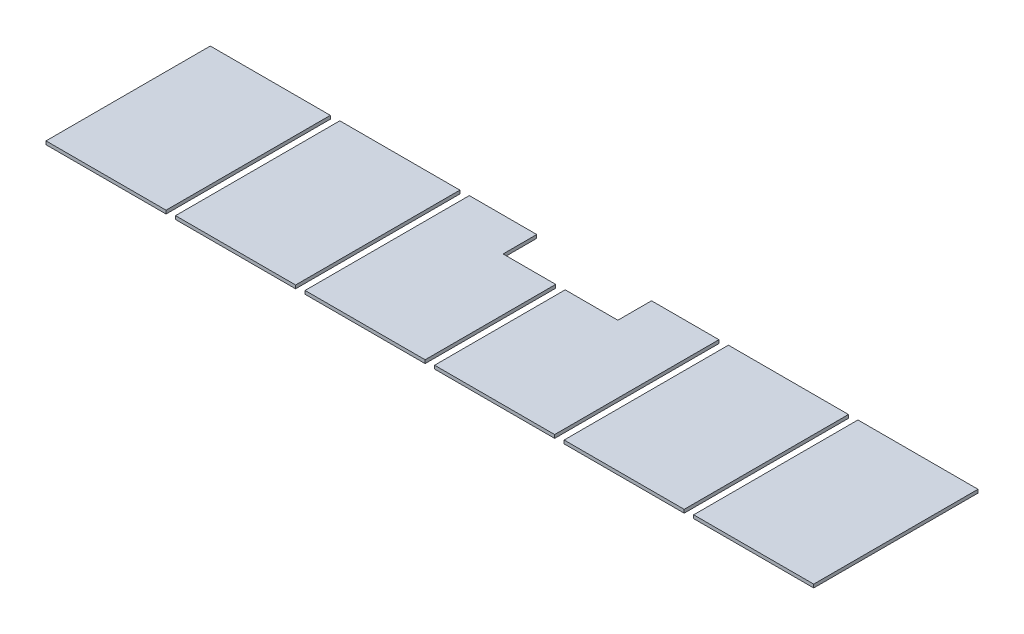
ISO-10303-21;
HEADER;
FILE_DESCRIPTION(('STEP AP214'),'2;1');
FILE_NAME('part.step','',(''),(''),'','','');
FILE_SCHEMA(('AUTOMOTIVE_DESIGN { 1 0 10303 214 1 1 1 1 }'));
ENDSEC;
DATA;
#1=APPLICATION_CONTEXT('core data for automotive mechanical design processes');
#2=APPLICATION_PROTOCOL_DEFINITION('international standard','automotive_design',2000,#1);
#3=PRODUCT_CONTEXT('',#1,'mechanical');
#4=PRODUCT('Part','Part','',(#3));
#5=PRODUCT_RELATED_PRODUCT_CATEGORY('part','',(#4));
#6=PRODUCT_DEFINITION_FORMATION('','',#4);
#7=PRODUCT_DEFINITION_CONTEXT('part definition',#1,'design');
#8=PRODUCT_DEFINITION('design','',#6,#7);
#9=PRODUCT_DEFINITION_SHAPE('','',#8);
#10=(LENGTH_UNIT() NAMED_UNIT(*) SI_UNIT(.MILLI.,.METRE.));
#11=(NAMED_UNIT(*) PLANE_ANGLE_UNIT() SI_UNIT($,.RADIAN.));
#12=(NAMED_UNIT(*) SI_UNIT($,.STERADIAN.) SOLID_ANGLE_UNIT());
#13=UNCERTAINTY_MEASURE_WITH_UNIT(LENGTH_MEASURE(1.E-05),#10,'distance_accuracy_value','');
#14=(GEOMETRIC_REPRESENTATION_CONTEXT(3) GLOBAL_UNCERTAINTY_ASSIGNED_CONTEXT((#13)) GLOBAL_UNIT_ASSIGNED_CONTEXT((#10,
#11,#12)) REPRESENTATION_CONTEXT('',''));
#15=CARTESIAN_POINT('',(0.,0.,0.));
#16=DIRECTION('',(0.,0.,1.));
#17=DIRECTION('',(1.,0.,0.));
#18=AXIS2_PLACEMENT_3D('',#15,#16,#17);
#19=CARTESIAN_POINT('',(0.,2494.46930946714,-63.5000000000028));
#20=DIRECTION('',(0.,0.,-1.));
#21=DIRECTION('',(-1.,0.,0.));
#22=AXIS2_PLACEMENT_3D('',#19,#20,#21);
#23=PLANE('',#22);
#24=DIRECTION('',(1.,0.,0.));
#25=VECTOR('',#24,1.);
#26=CARTESIAN_POINT('',(0.,40.6399999999998,-63.5000000000028));
#27=LINE('',#26,#25);
#28=CARTESIAN_POINT('',(7874.,40.6399999999998,-63.5000000000028));
#29=VERTEX_POINT('',#28);
#30=CARTESIAN_POINT('',(9321.8,40.6399999999998,-63.5000000000028));
#31=VERTEX_POINT('',#30);
#32=EDGE_CURVE('E97',#29,#31,#27,.T.);
#33=ORIENTED_EDGE('',*,*,#32,.F.);
#34=DIRECTION('',(0.,-1.,0.));
#35=VECTOR('',#34,1.);
#36=CARTESIAN_POINT('',(7874.,2494.46930946714,-63.5000000000028));
#37=LINE('',#36,#35);
#38=CARTESIAN_POINT('',(7874.,0.,-63.5000000000028));
#39=VERTEX_POINT('',#38);
#40=EDGE_CURVE('E51',#29,#39,#37,.T.);
#41=ORIENTED_EDGE('',*,*,#40,.T.);
#42=DIRECTION('',(1.,0.,0.));
#43=VECTOR('',#42,1.);
#44=CARTESIAN_POINT('',(0.,0.,-63.5000000000028));
#45=LINE('',#44,#43);
#46=CARTESIAN_POINT('',(9321.8,0.,-63.5000000000028));
#47=VERTEX_POINT('',#46);
#48=EDGE_CURVE('E95',#39,#47,#45,.T.);
#49=ORIENTED_EDGE('',*,*,#48,.T.);
#50=DIRECTION('',(0.,-1.,0.));
#51=VECTOR('',#50,1.);
#52=CARTESIAN_POINT('',(9321.8,2494.46930946714,-63.5000000000028));
#53=LINE('',#52,#51);
#54=EDGE_CURVE('E86',#31,#47,#53,.T.);
#55=ORIENTED_EDGE('',*,*,#54,.F.);
#56=EDGE_LOOP('',(#33,#41,#49,#55));
#57=FACE_BOUND('',#56,.T.);
#58=ADVANCED_FACE('F47',(#57),#23,.F.);
#59=CARTESIAN_POINT('',(9321.8,2494.46930946714,0.));
#60=DIRECTION('',(-1.,0.,0.));
#61=DIRECTION('',(0.,0.,1.));
#62=AXIS2_PLACEMENT_3D('',#59,#60,#61);
#63=PLANE('',#62);
#64=DIRECTION('',(0.,0.,-1.));
#65=VECTOR('',#64,1.);
#66=CARTESIAN_POINT('',(9321.8,40.6399999999998,0.));
#67=LINE('',#66,#65);
#68=CARTESIAN_POINT('',(9321.8,40.6399999999998,-2044.7));
#69=VERTEX_POINT('',#68);
#70=EDGE_CURVE('E56',#31,#69,#67,.T.);
#71=ORIENTED_EDGE('',*,*,#70,.F.);
#72=ORIENTED_EDGE('',*,*,#54,.T.);
#73=DIRECTION('',(0.,0.,-1.));
#74=VECTOR('',#73,1.);
#75=CARTESIAN_POINT('',(9321.8,0.,0.));
#76=LINE('',#75,#74);
#77=CARTESIAN_POINT('',(9321.8,0.,-2044.7));
#78=VERTEX_POINT('',#77);
#79=EDGE_CURVE('E107',#47,#78,#76,.T.);
#80=ORIENTED_EDGE('',*,*,#79,.T.);
#81=DIRECTION('',(0.,-1.,0.));
#82=VECTOR('',#81,1.);
#83=CARTESIAN_POINT('',(9321.8,2494.46930946714,-2044.7));
#84=LINE('',#83,#82);
#85=EDGE_CURVE('E116',#69,#78,#84,.T.);
#86=ORIENTED_EDGE('',*,*,#85,.F.);
#87=EDGE_LOOP('',(#71,#72,#80,#86));
#88=FACE_BOUND('',#87,.T.);
#89=ADVANCED_FACE('F120',(#88),#63,.F.);
#90=CARTESIAN_POINT('',(0.,2494.46930946714,-2044.7));
#91=DIRECTION('',(0.,0.,1.));
#92=DIRECTION('',(1.,0.,0.));
#93=AXIS2_PLACEMENT_3D('',#90,#91,#92);
#94=PLANE('',#93);
#95=DIRECTION('',(-1.,0.,0.));
#96=VECTOR('',#95,1.);
#97=CARTESIAN_POINT('',(0.,40.6399999999998,-2044.7));
#98=LINE('',#97,#96);
#99=CARTESIAN_POINT('',(7874.,40.6399999999998,-2044.7));
#100=VERTEX_POINT('',#99);
#101=EDGE_CURVE('E12',#69,#100,#98,.T.);
#102=ORIENTED_EDGE('',*,*,#101,.F.);
#103=ORIENTED_EDGE('',*,*,#85,.T.);
#104=DIRECTION('',(-1.,0.,0.));
#105=VECTOR('',#104,1.);
#106=CARTESIAN_POINT('',(0.,0.,-2044.7));
#107=LINE('',#106,#105);
#108=CARTESIAN_POINT('',(7874.,0.,-2044.7));
#109=VERTEX_POINT('',#108);
#110=EDGE_CURVE('E117',#78,#109,#107,.T.);
#111=ORIENTED_EDGE('',*,*,#110,.T.);
#112=DIRECTION('',(0.,-1.,0.));
#113=VECTOR('',#112,1.);
#114=CARTESIAN_POINT('',(7874.,2494.46930946714,-2044.7));
#115=LINE('',#114,#113);
#116=EDGE_CURVE('E69',#100,#109,#115,.T.);
#117=ORIENTED_EDGE('',*,*,#116,.F.);
#118=EDGE_LOOP('',(#102,#103,#111,#117));
#119=FACE_BOUND('',#118,.T.);
#120=ADVANCED_FACE('F119',(#119),#94,.F.);
#121=CARTESIAN_POINT('',(7874.,2494.46930946714,0.));
#122=DIRECTION('',(1.,0.,0.));
#123=DIRECTION('',(0.,0.,-1.));
#124=AXIS2_PLACEMENT_3D('',#121,#122,#123);
#125=PLANE('',#124);
#126=DIRECTION('',(0.,0.,1.));
#127=VECTOR('',#126,1.);
#128=CARTESIAN_POINT('',(7874.,40.6399999999998,0.));
#129=LINE('',#128,#127);
#130=EDGE_CURVE('E104',#100,#29,#129,.T.);
#131=ORIENTED_EDGE('',*,*,#130,.F.);
#132=ORIENTED_EDGE('',*,*,#116,.T.);
#133=DIRECTION('',(0.,0.,1.));
#134=VECTOR('',#133,1.);
#135=CARTESIAN_POINT('',(7874.,0.,0.));
#136=LINE('',#135,#134);
#137=EDGE_CURVE('E100',#109,#39,#136,.T.);
#138=ORIENTED_EDGE('',*,*,#137,.T.);
#139=ORIENTED_EDGE('',*,*,#40,.F.);
#140=EDGE_LOOP('',(#131,#132,#138,#139));
#141=FACE_BOUND('',#140,.T.);
#142=ADVANCED_FACE('F101',(#141),#125,.F.);
#143=CARTESIAN_POINT('',(0.,0.,0.));
#144=DIRECTION('',(0.,1.,0.));
#145=DIRECTION('',(0.,0.,1.));
#146=AXIS2_PLACEMENT_3D('',#143,#144,#145);
#147=PLANE('',#146);
#148=ORIENTED_EDGE('',*,*,#48,.F.);
#149=ORIENTED_EDGE('',*,*,#137,.F.);
#150=ORIENTED_EDGE('',*,*,#110,.F.);
#151=ORIENTED_EDGE('',*,*,#79,.F.);
#152=EDGE_LOOP('',(#148,#149,#150,#151));
#153=FACE_BOUND('',#152,.T.);
#154=ADVANCED_FACE('F106',(#153),#147,.F.);
#155=CARTESIAN_POINT('',(0.,40.64,0.));
#156=DIRECTION('',(0.,1.,0.));
#157=DIRECTION('',(0.,0.,1.));
#158=AXIS2_PLACEMENT_3D('',#155,#156,#157);
#159=PLANE('',#158);
#160=ORIENTED_EDGE('',*,*,#130,.T.);
#161=ORIENTED_EDGE('',*,*,#32,.T.);
#162=ORIENTED_EDGE('',*,*,#70,.T.);
#163=ORIENTED_EDGE('',*,*,#101,.T.);
#164=EDGE_LOOP('',(#160,#161,#162,#163));
#165=FACE_BOUND('',#164,.T.);
#166=ADVANCED_FACE('F49',(#165),#159,.T.);
#167=CLOSED_SHELL('',(#58,#89,#120,#142,#154,#166));
#168=MANIFOLD_SOLID_BREP('B2',#167);
#169=CARTESIAN_POINT('',(7759.7,2494.46930946714,0.));
#170=DIRECTION('',(-1.,0.,0.));
#171=DIRECTION('',(0.,0.,1.));
#172=AXIS2_PLACEMENT_3D('',#169,#170,#171);
#173=PLANE('',#172);
#174=DIRECTION('',(0.,0.,-1.));
#175=VECTOR('',#174,1.);
#176=CARTESIAN_POINT('',(7759.7,40.6399999999998,0.));
#177=LINE('',#176,#175);
#178=CARTESIAN_POINT('',(7759.7,40.6399999999998,-63.5000000000028));
#179=VERTEX_POINT('',#178);
#180=CARTESIAN_POINT('',(7759.7,40.6399999999998,-2044.7));
#181=VERTEX_POINT('',#180);
#182=EDGE_CURVE('E230',#179,#181,#177,.T.);
#183=ORIENTED_EDGE('',*,*,#182,.F.);
#184=DIRECTION('',(0.,-1.,0.));
#185=VECTOR('',#184,1.);
#186=CARTESIAN_POINT('',(7759.7,2494.46930946714,-63.5000000000028));
#187=LINE('',#186,#185);
#188=CARTESIAN_POINT('',(7759.7,0.,-63.5000000000028));
#189=VERTEX_POINT('',#188);
#190=EDGE_CURVE('E184',#179,#189,#187,.T.);
#191=ORIENTED_EDGE('',*,*,#190,.T.);
#192=DIRECTION('',(0.,0.,-1.));
#193=VECTOR('',#192,1.);
#194=CARTESIAN_POINT('',(7759.7,0.,0.));
#195=LINE('',#194,#193);
#196=CARTESIAN_POINT('',(7759.7,0.,-2044.7));
#197=VERTEX_POINT('',#196);
#198=EDGE_CURVE('E228',#189,#197,#195,.T.);
#199=ORIENTED_EDGE('',*,*,#198,.T.);
#200=DIRECTION('',(0.,-1.,0.));
#201=VECTOR('',#200,1.);
#202=CARTESIAN_POINT('',(7759.7,2494.46930946714,-2044.7));
#203=LINE('',#202,#201);
#204=EDGE_CURVE('E219',#181,#197,#203,.T.);
#205=ORIENTED_EDGE('',*,*,#204,.F.);
#206=EDGE_LOOP('',(#183,#191,#199,#205));
#207=FACE_BOUND('',#206,.T.);
#208=ADVANCED_FACE('F180',(#207),#173,.F.);
#209=CARTESIAN_POINT('',(0.,2494.46930946714,-2044.7));
#210=DIRECTION('',(0.,0.,1.));
#211=DIRECTION('',(1.,0.,0.));
#212=AXIS2_PLACEMENT_3D('',#209,#210,#211);
#213=PLANE('',#212);
#214=DIRECTION('',(-1.,0.,0.));
#215=VECTOR('',#214,1.);
#216=CARTESIAN_POINT('',(0.,40.6399999999998,-2044.7));
#217=LINE('',#216,#215);
#218=CARTESIAN_POINT('',(6311.9,40.6399999999998,-2044.7));
#219=VERTEX_POINT('',#218);
#220=EDGE_CURVE('E189',#181,#219,#217,.T.);
#221=ORIENTED_EDGE('',*,*,#220,.F.);
#222=ORIENTED_EDGE('',*,*,#204,.T.);
#223=DIRECTION('',(-1.,0.,0.));
#224=VECTOR('',#223,1.);
#225=CARTESIAN_POINT('',(0.,0.,-2044.7));
#226=LINE('',#225,#224);
#227=CARTESIAN_POINT('',(6311.9,0.,-2044.7));
#228=VERTEX_POINT('',#227);
#229=EDGE_CURVE('E240',#197,#228,#226,.T.);
#230=ORIENTED_EDGE('',*,*,#229,.T.);
#231=DIRECTION('',(0.,-1.,0.));
#232=VECTOR('',#231,1.);
#233=CARTESIAN_POINT('',(6311.9,2494.46930946714,-2044.7));
#234=LINE('',#233,#232);
#235=EDGE_CURVE('E249',#219,#228,#234,.T.);
#236=ORIENTED_EDGE('',*,*,#235,.F.);
#237=EDGE_LOOP('',(#221,#222,#230,#236));
#238=FACE_BOUND('',#237,.T.);
#239=ADVANCED_FACE('F253',(#238),#213,.F.);
#240=CARTESIAN_POINT('',(6311.9,2494.46930946714,0.));
#241=DIRECTION('',(1.,0.,0.));
#242=DIRECTION('',(0.,0.,-1.));
#243=AXIS2_PLACEMENT_3D('',#240,#241,#242);
#244=PLANE('',#243);
#245=DIRECTION('',(0.,0.,1.));
#246=VECTOR('',#245,1.);
#247=CARTESIAN_POINT('',(6311.9,40.6399999999998,0.));
#248=LINE('',#247,#246);
#249=CARTESIAN_POINT('',(6311.9,40.6399999999998,-63.5000000000028));
#250=VERTEX_POINT('',#249);
#251=EDGE_CURVE('E45',#219,#250,#248,.T.);
#252=ORIENTED_EDGE('',*,*,#251,.F.);
#253=ORIENTED_EDGE('',*,*,#235,.T.);
#254=DIRECTION('',(0.,0.,1.));
#255=VECTOR('',#254,1.);
#256=CARTESIAN_POINT('',(6311.9,0.,0.));
#257=LINE('',#256,#255);
#258=CARTESIAN_POINT('',(6311.9,0.,-63.5000000000028));
#259=VERTEX_POINT('',#258);
#260=EDGE_CURVE('E250',#228,#259,#257,.T.);
#261=ORIENTED_EDGE('',*,*,#260,.T.);
#262=DIRECTION('',(0.,-1.,0.));
#263=VECTOR('',#262,1.);
#264=CARTESIAN_POINT('',(6311.9,2494.46930946714,-63.5000000000028));
#265=LINE('',#264,#263);
#266=EDGE_CURVE('E202',#250,#259,#265,.T.);
#267=ORIENTED_EDGE('',*,*,#266,.F.);
#268=EDGE_LOOP('',(#252,#253,#261,#267));
#269=FACE_BOUND('',#268,.T.);
#270=ADVANCED_FACE('F252',(#269),#244,.F.);
#271=CARTESIAN_POINT('',(0.,2494.46930946714,-63.5000000000028));
#272=DIRECTION('',(0.,0.,-1.));
#273=DIRECTION('',(-1.,0.,0.));
#274=AXIS2_PLACEMENT_3D('',#271,#272,#273);
#275=PLANE('',#274);
#276=DIRECTION('',(1.,0.,0.));
#277=VECTOR('',#276,1.);
#278=CARTESIAN_POINT('',(0.,40.6399999999998,-63.5000000000028));
#279=LINE('',#278,#277);
#280=EDGE_CURVE('E237',#250,#179,#279,.T.);
#281=ORIENTED_EDGE('',*,*,#280,.F.);
#282=ORIENTED_EDGE('',*,*,#266,.T.);
#283=DIRECTION('',(1.,0.,0.));
#284=VECTOR('',#283,1.);
#285=CARTESIAN_POINT('',(0.,0.,-63.5000000000028));
#286=LINE('',#285,#284);
#287=EDGE_CURVE('E233',#259,#189,#286,.T.);
#288=ORIENTED_EDGE('',*,*,#287,.T.);
#289=ORIENTED_EDGE('',*,*,#190,.F.);
#290=EDGE_LOOP('',(#281,#282,#288,#289));
#291=FACE_BOUND('',#290,.T.);
#292=ADVANCED_FACE('F234',(#291),#275,.F.);
#293=CARTESIAN_POINT('',(0.,0.,0.));
#294=DIRECTION('',(0.,1.,0.));
#295=DIRECTION('',(0.,0.,1.));
#296=AXIS2_PLACEMENT_3D('',#293,#294,#295);
#297=PLANE('',#296);
#298=ORIENTED_EDGE('',*,*,#198,.F.);
#299=ORIENTED_EDGE('',*,*,#287,.F.);
#300=ORIENTED_EDGE('',*,*,#260,.F.);
#301=ORIENTED_EDGE('',*,*,#229,.F.);
#302=EDGE_LOOP('',(#298,#299,#300,#301));
#303=FACE_BOUND('',#302,.T.);
#304=ADVANCED_FACE('F239',(#303),#297,.F.);
#305=CARTESIAN_POINT('',(0.,40.64,0.));
#306=DIRECTION('',(0.,1.,0.));
#307=DIRECTION('',(0.,0.,1.));
#308=AXIS2_PLACEMENT_3D('',#305,#306,#307);
#309=PLANE('',#308);
#310=ORIENTED_EDGE('',*,*,#280,.T.);
#311=ORIENTED_EDGE('',*,*,#182,.T.);
#312=ORIENTED_EDGE('',*,*,#220,.T.);
#313=ORIENTED_EDGE('',*,*,#251,.T.);
#314=EDGE_LOOP('',(#310,#311,#312,#313));
#315=FACE_BOUND('',#314,.T.);
#316=ADVANCED_FACE('F182',(#315),#309,.T.);
#317=CLOSED_SHELL('',(#208,#239,#270,#292,#304,#316));
#318=MANIFOLD_SOLID_BREP('B6',#317);
#319=CARTESIAN_POINT('',(0.,2494.46930946714,-2044.7));
#320=DIRECTION('',(0.,0.,1.));
#321=DIRECTION('',(1.,0.,0.));
#322=AXIS2_PLACEMENT_3D('',#319,#320,#321);
#323=PLANE('',#322);
#324=DIRECTION('',(-1.,0.,0.));
#325=VECTOR('',#324,1.);
#326=CARTESIAN_POINT('',(0.,40.6399999999998,-2044.7));
#327=LINE('',#326,#325);
#328=CARTESIAN_POINT('',(6197.6,40.6399999999998,-2044.7));
#329=VERTEX_POINT('',#328);
#330=CARTESIAN_POINT('',(5384.8,40.6399999999998,-2044.7));
#331=VERTEX_POINT('',#330);
#332=EDGE_CURVE('E394',#329,#331,#327,.T.);
#333=ORIENTED_EDGE('',*,*,#332,.F.);
#334=DIRECTION('',(0.,-1.,0.));
#335=VECTOR('',#334,1.);
#336=CARTESIAN_POINT('',(6197.6,2494.46930946714,-2044.7));
#337=LINE('',#336,#335);
#338=CARTESIAN_POINT('',(6197.6,0.,-2044.7));
#339=VERTEX_POINT('',#338);
#340=EDGE_CURVE('E317',#329,#339,#337,.T.);
#341=ORIENTED_EDGE('',*,*,#340,.T.);
#342=DIRECTION('',(-1.,0.,0.));
#343=VECTOR('',#342,1.);
#344=CARTESIAN_POINT('',(0.,0.,-2044.7));
#345=LINE('',#344,#343);
#346=CARTESIAN_POINT('',(5384.8,0.,-2044.7));
#347=VERTEX_POINT('',#346);
#348=EDGE_CURVE('E402',#339,#347,#345,.T.);
#349=ORIENTED_EDGE('',*,*,#348,.T.);
#350=DIRECTION('',(0.,-1.,0.));
#351=VECTOR('',#350,1.);
#352=CARTESIAN_POINT('',(5384.8,2494.46930946714,-2044.7));
#353=LINE('',#352,#351);
#354=EDGE_CURVE('E360',#331,#347,#353,.T.);
#355=ORIENTED_EDGE('',*,*,#354,.F.);
#356=EDGE_LOOP('',(#333,#341,#349,#355));
#357=FACE_BOUND('',#356,.T.);
#358=ADVANCED_FACE('F313',(#357),#323,.F.);
#359=CARTESIAN_POINT('',(5384.8,2494.46930946714,0.));
#360=DIRECTION('',(1.,0.,0.));
#361=DIRECTION('',(0.,0.,-1.));
#362=AXIS2_PLACEMENT_3D('',#359,#360,#361);
#363=PLANE('',#362);
#364=DIRECTION('',(0.,0.,1.));
#365=VECTOR('',#364,1.);
#366=CARTESIAN_POINT('',(5384.8,40.6399999999998,0.));
#367=LINE('',#366,#365);
#368=CARTESIAN_POINT('',(5384.8,40.6399999999998,-1638.3));
#369=VERTEX_POINT('',#368);
#370=EDGE_CURVE('E367',#331,#369,#367,.T.);
#371=ORIENTED_EDGE('',*,*,#370,.F.);
#372=ORIENTED_EDGE('',*,*,#354,.T.);
#373=DIRECTION('',(0.,0.,1.));
#374=VECTOR('',#373,1.);
#375=CARTESIAN_POINT('',(5384.8,0.,0.));
#376=LINE('',#375,#374);
#377=CARTESIAN_POINT('',(5384.8,0.,-1638.3));
#378=VERTEX_POINT('',#377);
#379=EDGE_CURVE('E401',#347,#378,#376,.T.);
#380=ORIENTED_EDGE('',*,*,#379,.T.);
#381=DIRECTION('',(0.,-1.,0.));
#382=VECTOR('',#381,1.);
#383=CARTESIAN_POINT('',(5384.8,2494.46930946714,-1638.3));
#384=LINE('',#383,#382);
#385=EDGE_CURVE('E403',#369,#378,#384,.T.);
#386=ORIENTED_EDGE('',*,*,#385,.F.);
#387=EDGE_LOOP('',(#371,#372,#380,#386));
#388=FACE_BOUND('',#387,.T.);
#389=ADVANCED_FACE('F421',(#388),#363,.F.);
#390=CARTESIAN_POINT('',(0.,2494.46930946714,-1638.3));
#391=DIRECTION('',(0.,0.,1.));
#392=DIRECTION('',(1.,0.,0.));
#393=AXIS2_PLACEMENT_3D('',#390,#391,#392);
#394=PLANE('',#393);
#395=DIRECTION('',(-1.,0.,0.));
#396=VECTOR('',#395,1.);
#397=CARTESIAN_POINT('',(0.,40.6399999999998,-1638.3));
#398=LINE('',#397,#396);
#399=CARTESIAN_POINT('',(4749.8,40.6399999999998,-1638.3));
#400=VERTEX_POINT('',#399);
#401=EDGE_CURVE('E388',#369,#400,#398,.T.);
#402=ORIENTED_EDGE('',*,*,#401,.F.);
#403=ORIENTED_EDGE('',*,*,#385,.T.);
#404=DIRECTION('',(-1.,0.,0.));
#405=VECTOR('',#404,1.);
#406=CARTESIAN_POINT('',(0.,0.,-1638.3));
#407=LINE('',#406,#405);
#408=CARTESIAN_POINT('',(4749.8,0.,-1638.3));
#409=VERTEX_POINT('',#408);
#410=EDGE_CURVE('E405',#378,#409,#407,.T.);
#411=ORIENTED_EDGE('',*,*,#410,.T.);
#412=DIRECTION('',(0.,-1.,0.));
#413=VECTOR('',#412,1.);
#414=CARTESIAN_POINT('',(4749.8,2494.46930946714,-1638.3));
#415=LINE('',#414,#413);
#416=EDGE_CURVE('E406',#400,#409,#415,.T.);
#417=ORIENTED_EDGE('',*,*,#416,.F.);
#418=EDGE_LOOP('',(#402,#403,#411,#417));
#419=FACE_BOUND('',#418,.T.);
#420=ADVANCED_FACE('F423',(#419),#394,.F.);
#421=CARTESIAN_POINT('',(4749.8,2494.46930946714,0.));
#422=DIRECTION('',(1.,0.,0.));
#423=DIRECTION('',(0.,0.,-1.));
#424=AXIS2_PLACEMENT_3D('',#421,#422,#423);
#425=PLANE('',#424);
#426=DIRECTION('',(0.,0.,1.));
#427=VECTOR('',#426,1.);
#428=CARTESIAN_POINT('',(4749.8,40.6399999999998,0.));
#429=LINE('',#428,#427);
#430=CARTESIAN_POINT('',(4749.8,40.6399999999998,-63.5000000000028));
#431=VERTEX_POINT('',#430);
#432=EDGE_CURVE('E322',#400,#431,#429,.T.);
#433=ORIENTED_EDGE('',*,*,#432,.F.);
#434=ORIENTED_EDGE('',*,*,#416,.T.);
#435=DIRECTION('',(0.,0.,1.));
#436=VECTOR('',#435,1.);
#437=CARTESIAN_POINT('',(4749.8,0.,0.));
#438=LINE('',#437,#436);
#439=CARTESIAN_POINT('',(4749.8,0.,-63.5000000000028));
#440=VERTEX_POINT('',#439);
#441=EDGE_CURVE('E383',#409,#440,#438,.T.);
#442=ORIENTED_EDGE('',*,*,#441,.T.);
#443=DIRECTION('',(0.,-1.,0.));
#444=VECTOR('',#443,1.);
#445=CARTESIAN_POINT('',(4749.8,2494.46930946714,-63.5000000000028));
#446=LINE('',#445,#444);
#447=EDGE_CURVE('E374',#431,#440,#446,.T.);
#448=ORIENTED_EDGE('',*,*,#447,.F.);
#449=EDGE_LOOP('',(#433,#434,#442,#448));
#450=FACE_BOUND('',#449,.T.);
#451=ADVANCED_FACE('F380',(#450),#425,.F.);
#452=CARTESIAN_POINT('',(0.,2494.46930946714,-63.5000000000028));
#453=DIRECTION('',(0.,0.,-1.));
#454=DIRECTION('',(-1.,0.,0.));
#455=AXIS2_PLACEMENT_3D('',#452,#453,#454);
#456=PLANE('',#455);
#457=DIRECTION('',(1.,0.,0.));
#458=VECTOR('',#457,1.);
#459=CARTESIAN_POINT('',(0.,40.6399999999998,-63.5000000000028));
#460=LINE('',#459,#458);
#461=CARTESIAN_POINT('',(6197.6,40.6399999999998,-63.5000000000028));
#462=VERTEX_POINT('',#461);
#463=EDGE_CURVE('E178',#431,#462,#460,.T.);
#464=ORIENTED_EDGE('',*,*,#463,.F.);
#465=ORIENTED_EDGE('',*,*,#447,.T.);
#466=DIRECTION('',(1.,0.,0.));
#467=VECTOR('',#466,1.);
#468=CARTESIAN_POINT('',(0.,0.,-63.5000000000028));
#469=LINE('',#468,#467);
#470=CARTESIAN_POINT('',(6197.6,0.,-63.5000000000028));
#471=VERTEX_POINT('',#470);
#472=EDGE_CURVE('E385',#440,#471,#469,.T.);
#473=ORIENTED_EDGE('',*,*,#472,.T.);
#474=DIRECTION('',(0.,-1.,0.));
#475=VECTOR('',#474,1.);
#476=CARTESIAN_POINT('',(6197.6,2494.46930946714,-63.5000000000028));
#477=LINE('',#476,#475);
#478=EDGE_CURVE('E335',#462,#471,#477,.T.);
#479=ORIENTED_EDGE('',*,*,#478,.F.);
#480=EDGE_LOOP('',(#464,#465,#473,#479));
#481=FACE_BOUND('',#480,.T.);
#482=ADVANCED_FACE('F373',(#481),#456,.F.);
#483=CARTESIAN_POINT('',(6197.6,2494.46930946714,0.));
#484=DIRECTION('',(-1.,0.,0.));
#485=DIRECTION('',(0.,0.,1.));
#486=AXIS2_PLACEMENT_3D('',#483,#484,#485);
#487=PLANE('',#486);
#488=DIRECTION('',(0.,0.,-1.));
#489=VECTOR('',#488,1.);
#490=CARTESIAN_POINT('',(6197.6,40.6399999999998,0.));
#491=LINE('',#490,#489);
#492=EDGE_CURVE('E397',#462,#329,#491,.T.);
#493=ORIENTED_EDGE('',*,*,#492,.F.);
#494=ORIENTED_EDGE('',*,*,#478,.T.);
#495=DIRECTION('',(0.,0.,-1.));
#496=VECTOR('',#495,1.);
#497=CARTESIAN_POINT('',(6197.6,0.,0.));
#498=LINE('',#497,#496);
#499=EDGE_CURVE('E399',#471,#339,#498,.T.);
#500=ORIENTED_EDGE('',*,*,#499,.T.);
#501=ORIENTED_EDGE('',*,*,#340,.F.);
#502=EDGE_LOOP('',(#493,#494,#500,#501));
#503=FACE_BOUND('',#502,.T.);
#504=ADVANCED_FACE('F417',(#503),#487,.F.);
#505=CARTESIAN_POINT('',(0.,0.,0.));
#506=DIRECTION('',(0.,1.,0.));
#507=DIRECTION('',(0.,0.,1.));
#508=AXIS2_PLACEMENT_3D('',#505,#506,#507);
#509=PLANE('',#508);
#510=ORIENTED_EDGE('',*,*,#348,.F.);
#511=ORIENTED_EDGE('',*,*,#499,.F.);
#512=ORIENTED_EDGE('',*,*,#472,.F.);
#513=ORIENTED_EDGE('',*,*,#441,.F.);
#514=ORIENTED_EDGE('',*,*,#410,.F.);
#515=ORIENTED_EDGE('',*,*,#379,.F.);
#516=EDGE_LOOP('',(#510,#511,#512,#513,#514,#515));
#517=FACE_BOUND('',#516,.T.);
#518=ADVANCED_FACE('F419',(#517),#509,.F.);
#519=CARTESIAN_POINT('',(0.,40.64,0.));
#520=DIRECTION('',(0.,1.,0.));
#521=DIRECTION('',(0.,0.,1.));
#522=AXIS2_PLACEMENT_3D('',#519,#520,#521);
#523=PLANE('',#522);
#524=ORIENTED_EDGE('',*,*,#492,.T.);
#525=ORIENTED_EDGE('',*,*,#332,.T.);
#526=ORIENTED_EDGE('',*,*,#370,.T.);
#527=ORIENTED_EDGE('',*,*,#401,.T.);
#528=ORIENTED_EDGE('',*,*,#432,.T.);
#529=ORIENTED_EDGE('',*,*,#463,.T.);
#530=EDGE_LOOP('',(#524,#525,#526,#527,#528,#529));
#531=FACE_BOUND('',#530,.T.);
#532=ADVANCED_FACE('F315',(#531),#523,.T.);
#533=CLOSED_SHELL('',(#358,#389,#420,#451,#482,#504,#518,#532));
#534=MANIFOLD_SOLID_BREP('B39',#533);
#535=CARTESIAN_POINT('',(3187.7,2494.46930946714,0.));
#536=DIRECTION('',(1.,0.,0.));
#537=DIRECTION('',(0.,0.,-1.));
#538=AXIS2_PLACEMENT_3D('',#535,#536,#537);
#539=PLANE('',#538);
#540=DIRECTION('',(0.,0.,1.));
#541=VECTOR('',#540,1.);
#542=CARTESIAN_POINT('',(3187.7,40.6399999999998,0.));
#543=LINE('',#542,#541);
#544=CARTESIAN_POINT('',(3187.7,40.6399999999998,-2044.7));
#545=VERTEX_POINT('',#544);
#546=CARTESIAN_POINT('',(3187.7,40.6399999999998,-63.5000000000028));
#547=VERTEX_POINT('',#546);
#548=EDGE_CURVE('E579',#545,#547,#543,.T.);
#549=ORIENTED_EDGE('',*,*,#548,.F.);
#550=DIRECTION('',(0.,-1.,0.));
#551=VECTOR('',#550,1.);
#552=CARTESIAN_POINT('',(3187.7,2494.46930946714,-2044.7));
#553=LINE('',#552,#551);
#554=CARTESIAN_POINT('',(3187.7,0.,-2044.7));
#555=VERTEX_POINT('',#554);
#556=EDGE_CURVE('E502',#545,#555,#553,.T.);
#557=ORIENTED_EDGE('',*,*,#556,.T.);
#558=DIRECTION('',(0.,0.,1.));
#559=VECTOR('',#558,1.);
#560=CARTESIAN_POINT('',(3187.7,0.,0.));
#561=LINE('',#560,#559);
#562=CARTESIAN_POINT('',(3187.7,0.,-63.5000000000028));
#563=VERTEX_POINT('',#562);
#564=EDGE_CURVE('E587',#555,#563,#561,.T.);
#565=ORIENTED_EDGE('',*,*,#564,.T.);
#566=DIRECTION('',(0.,-1.,0.));
#567=VECTOR('',#566,1.);
#568=CARTESIAN_POINT('',(3187.7,2494.46930946714,-63.5000000000028));
#569=LINE('',#568,#567);
#570=EDGE_CURVE('E545',#547,#563,#569,.T.);
#571=ORIENTED_EDGE('',*,*,#570,.F.);
#572=EDGE_LOOP('',(#549,#557,#565,#571));
#573=FACE_BOUND('',#572,.T.);
#574=ADVANCED_FACE('F498',(#573),#539,.F.);
#575=CARTESIAN_POINT('',(0.,2494.46930946714,-63.5000000000028));
#576=DIRECTION('',(0.,0.,-1.));
#577=DIRECTION('',(-1.,0.,0.));
#578=AXIS2_PLACEMENT_3D('',#575,#576,#577);
#579=PLANE('',#578);
#580=DIRECTION('',(1.,0.,0.));
#581=VECTOR('',#580,1.);
#582=CARTESIAN_POINT('',(0.,40.6399999999998,-63.5000000000028));
#583=LINE('',#582,#581);
#584=CARTESIAN_POINT('',(4635.5,40.6399999999998,-63.5000000000028));
#585=VERTEX_POINT('',#584);
#586=EDGE_CURVE('E552',#547,#585,#583,.T.);
#587=ORIENTED_EDGE('',*,*,#586,.F.);
#588=ORIENTED_EDGE('',*,*,#570,.T.);
#589=DIRECTION('',(1.,0.,0.));
#590=VECTOR('',#589,1.);
#591=CARTESIAN_POINT('',(0.,0.,-63.5000000000028));
#592=LINE('',#591,#590);
#593=CARTESIAN_POINT('',(4635.5,0.,-63.5000000000028));
#594=VERTEX_POINT('',#593);
#595=EDGE_CURVE('E586',#563,#594,#592,.T.);
#596=ORIENTED_EDGE('',*,*,#595,.T.);
#597=DIRECTION('',(0.,-1.,0.));
#598=VECTOR('',#597,1.);
#599=CARTESIAN_POINT('',(4635.5,2494.46930946714,-63.5000000000028));
#600=LINE('',#599,#598);
#601=EDGE_CURVE('E588',#585,#594,#600,.T.);
#602=ORIENTED_EDGE('',*,*,#601,.F.);
#603=EDGE_LOOP('',(#587,#588,#596,#602));
#604=FACE_BOUND('',#603,.T.);
#605=ADVANCED_FACE('F606',(#604),#579,.F.);
#606=CARTESIAN_POINT('',(4635.5,2494.46930946714,0.));
#607=DIRECTION('',(-1.,0.,0.));
#608=DIRECTION('',(0.,0.,1.));
#609=AXIS2_PLACEMENT_3D('',#606,#607,#608);
#610=PLANE('',#609);
#611=DIRECTION('',(0.,0.,-1.));
#612=VECTOR('',#611,1.);
#613=CARTESIAN_POINT('',(4635.5,40.6399999999998,0.));
#614=LINE('',#613,#612);
#615=CARTESIAN_POINT('',(4635.5,40.6399999999998,-1638.3));
#616=VERTEX_POINT('',#615);
#617=EDGE_CURVE('E573',#585,#616,#614,.T.);
#618=ORIENTED_EDGE('',*,*,#617,.F.);
#619=ORIENTED_EDGE('',*,*,#601,.T.);
#620=DIRECTION('',(0.,0.,-1.));
#621=VECTOR('',#620,1.);
#622=CARTESIAN_POINT('',(4635.5,0.,0.));
#623=LINE('',#622,#621);
#624=CARTESIAN_POINT('',(4635.5,0.,-1638.3));
#625=VERTEX_POINT('',#624);
#626=EDGE_CURVE('E590',#594,#625,#623,.T.);
#627=ORIENTED_EDGE('',*,*,#626,.T.);
#628=DIRECTION('',(0.,-1.,0.));
#629=VECTOR('',#628,1.);
#630=CARTESIAN_POINT('',(4635.5,2494.46930946714,-1638.3));
#631=LINE('',#630,#629);
#632=EDGE_CURVE('E591',#616,#625,#631,.T.);
#633=ORIENTED_EDGE('',*,*,#632,.F.);
#634=EDGE_LOOP('',(#618,#619,#627,#633));
#635=FACE_BOUND('',#634,.T.);
#636=ADVANCED_FACE('F608',(#635),#610,.F.);
#637=CARTESIAN_POINT('',(0.,2494.46930946714,-1638.3));
#638=DIRECTION('',(0.,0.,1.));
#639=DIRECTION('',(1.,0.,0.));
#640=AXIS2_PLACEMENT_3D('',#637,#638,#639);
#641=PLANE('',#640);
#642=DIRECTION('',(-1.,0.,0.));
#643=VECTOR('',#642,1.);
#644=CARTESIAN_POINT('',(0.,40.6399999999998,-1638.3));
#645=LINE('',#644,#643);
#646=CARTESIAN_POINT('',(4000.5,40.6399999999998,-1638.3));
#647=VERTEX_POINT('',#646);
#648=EDGE_CURVE('E507',#616,#647,#645,.T.);
#649=ORIENTED_EDGE('',*,*,#648,.F.);
#650=ORIENTED_EDGE('',*,*,#632,.T.);
#651=DIRECTION('',(-1.,0.,0.));
#652=VECTOR('',#651,1.);
#653=CARTESIAN_POINT('',(0.,0.,-1638.3));
#654=LINE('',#653,#652);
#655=CARTESIAN_POINT('',(4000.5,0.,-1638.3));
#656=VERTEX_POINT('',#655);
#657=EDGE_CURVE('E568',#625,#656,#654,.T.);
#658=ORIENTED_EDGE('',*,*,#657,.T.);
#659=DIRECTION('',(0.,-1.,0.));
#660=VECTOR('',#659,1.);
#661=CARTESIAN_POINT('',(4000.5,2494.46930946714,-1638.3));
#662=LINE('',#661,#660);
#663=EDGE_CURVE('E559',#647,#656,#662,.T.);
#664=ORIENTED_EDGE('',*,*,#663,.F.);
#665=EDGE_LOOP('',(#649,#650,#658,#664));
#666=FACE_BOUND('',#665,.T.);
#667=ADVANCED_FACE('F565',(#666),#641,.F.);
#668=CARTESIAN_POINT('',(4000.5,2494.46930946714,0.));
#669=DIRECTION('',(-1.,0.,0.));
#670=DIRECTION('',(0.,0.,1.));
#671=AXIS2_PLACEMENT_3D('',#668,#669,#670);
#672=PLANE('',#671);
#673=DIRECTION('',(0.,0.,-1.));
#674=VECTOR('',#673,1.);
#675=CARTESIAN_POINT('',(4000.5,40.6399999999998,0.));
#676=LINE('',#675,#674);
#677=CARTESIAN_POINT('',(4000.5,40.6399999999998,-2044.7));
#678=VERTEX_POINT('',#677);
#679=EDGE_CURVE('E311',#647,#678,#676,.T.);
#680=ORIENTED_EDGE('',*,*,#679,.F.);
#681=ORIENTED_EDGE('',*,*,#663,.T.);
#682=DIRECTION('',(0.,0.,-1.));
#683=VECTOR('',#682,1.);
#684=CARTESIAN_POINT('',(4000.5,0.,0.));
#685=LINE('',#684,#683);
#686=CARTESIAN_POINT('',(4000.5,0.,-2044.7));
#687=VERTEX_POINT('',#686);
#688=EDGE_CURVE('E570',#656,#687,#685,.T.);
#689=ORIENTED_EDGE('',*,*,#688,.T.);
#690=DIRECTION('',(0.,-1.,0.));
#691=VECTOR('',#690,1.);
#692=CARTESIAN_POINT('',(4000.5,2494.46930946714,-2044.7));
#693=LINE('',#692,#691);
#694=EDGE_CURVE('E520',#678,#687,#693,.T.);
#695=ORIENTED_EDGE('',*,*,#694,.F.);
#696=EDGE_LOOP('',(#680,#681,#689,#695));
#697=FACE_BOUND('',#696,.T.);
#698=ADVANCED_FACE('F558',(#697),#672,.F.);
#699=CARTESIAN_POINT('',(0.,2494.46930946714,-2044.7));
#700=DIRECTION('',(0.,0.,1.));
#701=DIRECTION('',(1.,0.,0.));
#702=AXIS2_PLACEMENT_3D('',#699,#700,#701);
#703=PLANE('',#702);
#704=DIRECTION('',(-1.,0.,0.));
#705=VECTOR('',#704,1.);
#706=CARTESIAN_POINT('',(0.,40.6399999999998,-2044.7));
#707=LINE('',#706,#705);
#708=EDGE_CURVE('E582',#678,#545,#707,.T.);
#709=ORIENTED_EDGE('',*,*,#708,.F.);
#710=ORIENTED_EDGE('',*,*,#694,.T.);
#711=DIRECTION('',(-1.,0.,0.));
#712=VECTOR('',#711,1.);
#713=CARTESIAN_POINT('',(0.,0.,-2044.7));
#714=LINE('',#713,#712);
#715=EDGE_CURVE('E584',#687,#555,#714,.T.);
#716=ORIENTED_EDGE('',*,*,#715,.T.);
#717=ORIENTED_EDGE('',*,*,#556,.F.);
#718=EDGE_LOOP('',(#709,#710,#716,#717));
#719=FACE_BOUND('',#718,.T.);
#720=ADVANCED_FACE('F602',(#719),#703,.F.);
#721=CARTESIAN_POINT('',(0.,0.,0.));
#722=DIRECTION('',(0.,1.,0.));
#723=DIRECTION('',(0.,0.,1.));
#724=AXIS2_PLACEMENT_3D('',#721,#722,#723);
#725=PLANE('',#724);
#726=ORIENTED_EDGE('',*,*,#564,.F.);
#727=ORIENTED_EDGE('',*,*,#715,.F.);
#728=ORIENTED_EDGE('',*,*,#688,.F.);
#729=ORIENTED_EDGE('',*,*,#657,.F.);
#730=ORIENTED_EDGE('',*,*,#626,.F.);
#731=ORIENTED_EDGE('',*,*,#595,.F.);
#732=EDGE_LOOP('',(#726,#727,#728,#729,#730,#731));
#733=FACE_BOUND('',#732,.T.);
#734=ADVANCED_FACE('F604',(#733),#725,.F.);
#735=CARTESIAN_POINT('',(0.,40.64,0.));
#736=DIRECTION('',(0.,1.,0.));
#737=DIRECTION('',(0.,0.,1.));
#738=AXIS2_PLACEMENT_3D('',#735,#736,#737);
#739=PLANE('',#738);
#740=ORIENTED_EDGE('',*,*,#708,.T.);
#741=ORIENTED_EDGE('',*,*,#548,.T.);
#742=ORIENTED_EDGE('',*,*,#586,.T.);
#743=ORIENTED_EDGE('',*,*,#617,.T.);
#744=ORIENTED_EDGE('',*,*,#648,.T.);
#745=ORIENTED_EDGE('',*,*,#679,.T.);
#746=EDGE_LOOP('',(#740,#741,#742,#743,#744,#745));
#747=FACE_BOUND('',#746,.T.);
#748=ADVANCED_FACE('F500',(#747),#739,.T.);
#749=CLOSED_SHELL('',(#574,#605,#636,#667,#698,#720,#734,#748));
#750=MANIFOLD_SOLID_BREP('B172',#749);
#751=CARTESIAN_POINT('',(0.,2494.46930946714,-63.5000000000028));
#752=DIRECTION('',(0.,0.,-1.));
#753=DIRECTION('',(-1.,0.,0.));
#754=AXIS2_PLACEMENT_3D('',#751,#752,#753);
#755=PLANE('',#754);
#756=DIRECTION('',(1.,0.,0.));
#757=VECTOR('',#756,1.);
#758=CARTESIAN_POINT('',(0.,40.6399999999998,-63.5000000000028));
#759=LINE('',#758,#757);
#760=CARTESIAN_POINT('',(1625.6,40.6399999999998,-63.5000000000028));
#761=VERTEX_POINT('',#760);
#762=CARTESIAN_POINT('',(3073.4,40.6399999999998,-63.5000000000028));
#763=VERTEX_POINT('',#762);
#764=EDGE_CURVE('E732',#761,#763,#759,.T.);
#765=ORIENTED_EDGE('',*,*,#764,.F.);
#766=DIRECTION('',(0.,-1.,0.));
#767=VECTOR('',#766,1.);
#768=CARTESIAN_POINT('',(1625.6,2494.46930946714,-63.5000000000028));
#769=LINE('',#768,#767);
#770=CARTESIAN_POINT('',(1625.6,0.,-63.5000000000028));
#771=VERTEX_POINT('',#770);
#772=EDGE_CURVE('E686',#761,#771,#769,.T.);
#773=ORIENTED_EDGE('',*,*,#772,.T.);
#774=DIRECTION('',(1.,0.,0.));
#775=VECTOR('',#774,1.);
#776=CARTESIAN_POINT('',(0.,0.,-63.5000000000028));
#777=LINE('',#776,#775);
#778=CARTESIAN_POINT('',(3073.4,0.,-63.5000000000028));
#779=VERTEX_POINT('',#778);
#780=EDGE_CURVE('E730',#771,#779,#777,.T.);
#781=ORIENTED_EDGE('',*,*,#780,.T.);
#782=DIRECTION('',(0.,-1.,0.));
#783=VECTOR('',#782,1.);
#784=CARTESIAN_POINT('',(3073.4,2494.46930946714,-63.5000000000028));
#785=LINE('',#784,#783);
#786=EDGE_CURVE('E721',#763,#779,#785,.T.);
#787=ORIENTED_EDGE('',*,*,#786,.F.);
#788=EDGE_LOOP('',(#765,#773,#781,#787));
#789=FACE_BOUND('',#788,.T.);
#790=ADVANCED_FACE('F682',(#789),#755,.F.);
#791=CARTESIAN_POINT('',(3073.4,2494.46930946714,0.));
#792=DIRECTION('',(-1.,0.,0.));
#793=DIRECTION('',(0.,0.,1.));
#794=AXIS2_PLACEMENT_3D('',#791,#792,#793);
#795=PLANE('',#794);
#796=DIRECTION('',(0.,0.,-1.));
#797=VECTOR('',#796,1.);
#798=CARTESIAN_POINT('',(3073.4,40.6399999999998,0.));
#799=LINE('',#798,#797);
#800=CARTESIAN_POINT('',(3073.4,40.6399999999998,-2044.7));
#801=VERTEX_POINT('',#800);
#802=EDGE_CURVE('E691',#763,#801,#799,.T.);
#803=ORIENTED_EDGE('',*,*,#802,.F.);
#804=ORIENTED_EDGE('',*,*,#786,.T.);
#805=DIRECTION('',(0.,0.,-1.));
#806=VECTOR('',#805,1.);
#807=CARTESIAN_POINT('',(3073.4,0.,0.));
#808=LINE('',#807,#806);
#809=CARTESIAN_POINT('',(3073.4,0.,-2044.7));
#810=VERTEX_POINT('',#809);
#811=EDGE_CURVE('E742',#779,#810,#808,.T.);
#812=ORIENTED_EDGE('',*,*,#811,.T.);
#813=DIRECTION('',(0.,-1.,0.));
#814=VECTOR('',#813,1.);
#815=CARTESIAN_POINT('',(3073.4,2494.46930946714,-2044.7));
#816=LINE('',#815,#814);
#817=EDGE_CURVE('E751',#801,#810,#816,.T.);
#818=ORIENTED_EDGE('',*,*,#817,.F.);
#819=EDGE_LOOP('',(#803,#804,#812,#818));
#820=FACE_BOUND('',#819,.T.);
#821=ADVANCED_FACE('F755',(#820),#795,.F.);
#822=CARTESIAN_POINT('',(0.,2494.46930946714,-2044.7));
#823=DIRECTION('',(0.,0.,1.));
#824=DIRECTION('',(1.,0.,0.));
#825=AXIS2_PLACEMENT_3D('',#822,#823,#824);
#826=PLANE('',#825);
#827=DIRECTION('',(-1.,0.,0.));
#828=VECTOR('',#827,1.);
#829=CARTESIAN_POINT('',(0.,40.6399999999998,-2044.7));
#830=LINE('',#829,#828);
#831=CARTESIAN_POINT('',(1625.6,40.6399999999998,-2044.7));
#832=VERTEX_POINT('',#831);
#833=EDGE_CURVE('E496',#801,#832,#830,.T.);
#834=ORIENTED_EDGE('',*,*,#833,.F.);
#835=ORIENTED_EDGE('',*,*,#817,.T.);
#836=DIRECTION('',(-1.,0.,0.));
#837=VECTOR('',#836,1.);
#838=CARTESIAN_POINT('',(0.,0.,-2044.7));
#839=LINE('',#838,#837);
#840=CARTESIAN_POINT('',(1625.6,0.,-2044.7));
#841=VERTEX_POINT('',#840);
#842=EDGE_CURVE('E752',#810,#841,#839,.T.);
#843=ORIENTED_EDGE('',*,*,#842,.T.);
#844=DIRECTION('',(0.,-1.,0.));
#845=VECTOR('',#844,1.);
#846=CARTESIAN_POINT('',(1625.6,2494.46930946714,-2044.7));
#847=LINE('',#846,#845);
#848=EDGE_CURVE('E704',#832,#841,#847,.T.);
#849=ORIENTED_EDGE('',*,*,#848,.F.);
#850=EDGE_LOOP('',(#834,#835,#843,#849));
#851=FACE_BOUND('',#850,.T.);
#852=ADVANCED_FACE('F754',(#851),#826,.F.);
#853=CARTESIAN_POINT('',(1625.6,2494.46930946714,0.));
#854=DIRECTION('',(1.,0.,0.));
#855=DIRECTION('',(0.,0.,-1.));
#856=AXIS2_PLACEMENT_3D('',#853,#854,#855);
#857=PLANE('',#856);
#858=DIRECTION('',(0.,0.,1.));
#859=VECTOR('',#858,1.);
#860=CARTESIAN_POINT('',(1625.6,40.6399999999998,0.));
#861=LINE('',#860,#859);
#862=EDGE_CURVE('E739',#832,#761,#861,.T.);
#863=ORIENTED_EDGE('',*,*,#862,.F.);
#864=ORIENTED_EDGE('',*,*,#848,.T.);
#865=DIRECTION('',(0.,0.,1.));
#866=VECTOR('',#865,1.);
#867=CARTESIAN_POINT('',(1625.6,0.,0.));
#868=LINE('',#867,#866);
#869=EDGE_CURVE('E735',#841,#771,#868,.T.);
#870=ORIENTED_EDGE('',*,*,#869,.T.);
#871=ORIENTED_EDGE('',*,*,#772,.F.);
#872=EDGE_LOOP('',(#863,#864,#870,#871));
#873=FACE_BOUND('',#872,.T.);
#874=ADVANCED_FACE('F736',(#873),#857,.F.);
#875=CARTESIAN_POINT('',(0.,0.,0.));
#876=DIRECTION('',(0.,1.,0.));
#877=DIRECTION('',(0.,0.,1.));
#878=AXIS2_PLACEMENT_3D('',#875,#876,#877);
#879=PLANE('',#878);
#880=ORIENTED_EDGE('',*,*,#780,.F.);
#881=ORIENTED_EDGE('',*,*,#869,.F.);
#882=ORIENTED_EDGE('',*,*,#842,.F.);
#883=ORIENTED_EDGE('',*,*,#811,.F.);
#884=EDGE_LOOP('',(#880,#881,#882,#883));
#885=FACE_BOUND('',#884,.T.);
#886=ADVANCED_FACE('F741',(#885),#879,.F.);
#887=CARTESIAN_POINT('',(0.,40.64,0.));
#888=DIRECTION('',(0.,1.,0.));
#889=DIRECTION('',(0.,0.,1.));
#890=AXIS2_PLACEMENT_3D('',#887,#888,#889);
#891=PLANE('',#890);
#892=ORIENTED_EDGE('',*,*,#862,.T.);
#893=ORIENTED_EDGE('',*,*,#764,.T.);
#894=ORIENTED_EDGE('',*,*,#802,.T.);
#895=ORIENTED_EDGE('',*,*,#833,.T.);
#896=EDGE_LOOP('',(#892,#893,#894,#895));
#897=FACE_BOUND('',#896,.T.);
#898=ADVANCED_FACE('F684',(#897),#891,.T.);
#899=CLOSED_SHELL('',(#790,#821,#852,#874,#886,#898));
#900=MANIFOLD_SOLID_BREP('B305',#899);
#901=CARTESIAN_POINT('',(0.,2494.46930946714,-63.500000000003));
#902=DIRECTION('',(0.,0.,-1.));
#903=DIRECTION('',(-1.,0.,0.));
#904=AXIS2_PLACEMENT_3D('',#901,#902,#903);
#905=PLANE('',#904);
#906=DIRECTION('',(1.,0.,0.));
#907=VECTOR('',#906,1.);
#908=CARTESIAN_POINT('',(0.,40.6399999999998,-63.500000000003));
#909=LINE('',#908,#907);
#910=CARTESIAN_POINT('',(63.4999999999997,40.6399999999998,-63.500000000003));
#911=VERTEX_POINT('',#910);
#912=CARTESIAN_POINT('',(1511.3,40.6399999999998,-63.5000000000029));
#913=VERTEX_POINT('',#912);
#914=EDGE_CURVE('E855',#911,#913,#909,.T.);
#915=ORIENTED_EDGE('',*,*,#914,.F.);
#916=DIRECTION('',(0.,-1.,0.));
#917=VECTOR('',#916,1.);
#918=CARTESIAN_POINT('',(63.4999999999997,2494.46930946714,-63.500000000003));
#919=LINE('',#918,#917);
#920=CARTESIAN_POINT('',(63.4999999999997,0.,-63.500000000003));
#921=VERTEX_POINT('',#920);
#922=EDGE_CURVE('E809',#911,#921,#919,.T.);
#923=ORIENTED_EDGE('',*,*,#922,.T.);
#924=DIRECTION('',(1.,0.,0.));
#925=VECTOR('',#924,1.);
#926=CARTESIAN_POINT('',(0.,0.,-63.500000000003));
#927=LINE('',#926,#925);
#928=CARTESIAN_POINT('',(1511.3,0.,-63.5000000000029));
#929=VERTEX_POINT('',#928);
#930=EDGE_CURVE('E853',#921,#929,#927,.T.);
#931=ORIENTED_EDGE('',*,*,#930,.T.);
#932=DIRECTION('',(0.,-1.,0.));
#933=VECTOR('',#932,1.);
#934=CARTESIAN_POINT('',(1511.3,2494.46930946714,-63.5000000000029));
#935=LINE('',#934,#933);
#936=EDGE_CURVE('E844',#913,#929,#935,.T.);
#937=ORIENTED_EDGE('',*,*,#936,.F.);
#938=EDGE_LOOP('',(#915,#923,#931,#937));
#939=FACE_BOUND('',#938,.T.);
#940=ADVANCED_FACE('F805',(#939),#905,.F.);
#941=CARTESIAN_POINT('',(1511.3,2494.46930946714,0.));
#942=DIRECTION('',(-1.,0.,0.));
#943=DIRECTION('',(0.,0.,1.));
#944=AXIS2_PLACEMENT_3D('',#941,#942,#943);
#945=PLANE('',#944);
#946=DIRECTION('',(0.,0.,-1.));
#947=VECTOR('',#946,1.);
#948=CARTESIAN_POINT('',(1511.3,40.6399999999998,0.));
#949=LINE('',#948,#947);
#950=CARTESIAN_POINT('',(1511.3,40.6399999999998,-2044.7));
#951=VERTEX_POINT('',#950);
#952=EDGE_CURVE('E814',#913,#951,#949,.T.);
#953=ORIENTED_EDGE('',*,*,#952,.F.);
#954=ORIENTED_EDGE('',*,*,#936,.T.);
#955=DIRECTION('',(0.,0.,-1.));
#956=VECTOR('',#955,1.);
#957=CARTESIAN_POINT('',(1511.3,0.,0.));
#958=LINE('',#957,#956);
#959=CARTESIAN_POINT('',(1511.3,0.,-2044.7));
#960=VERTEX_POINT('',#959);
#961=EDGE_CURVE('E865',#929,#960,#958,.T.);
#962=ORIENTED_EDGE('',*,*,#961,.T.);
#963=DIRECTION('',(0.,-1.,0.));
#964=VECTOR('',#963,1.);
#965=CARTESIAN_POINT('',(1511.3,2494.46930946714,-2044.7));
#966=LINE('',#965,#964);
#967=EDGE_CURVE('E874',#951,#960,#966,.T.);
#968=ORIENTED_EDGE('',*,*,#967,.F.);
#969=EDGE_LOOP('',(#953,#954,#962,#968));
#970=FACE_BOUND('',#969,.T.);
#971=ADVANCED_FACE('F878',(#970),#945,.F.);
#972=CARTESIAN_POINT('',(0.,2494.46930946714,-2044.7));
#973=DIRECTION('',(0.,0.,1.));
#974=DIRECTION('',(1.,0.,0.));
#975=AXIS2_PLACEMENT_3D('',#972,#973,#974);
#976=PLANE('',#975);
#977=DIRECTION('',(-1.,0.,0.));
#978=VECTOR('',#977,1.);
#979=CARTESIAN_POINT('',(0.,40.6399999999998,-2044.7));
#980=LINE('',#979,#978);
#981=CARTESIAN_POINT('',(63.4999999999997,40.6399999999998,-2044.7));
#982=VERTEX_POINT('',#981);
#983=EDGE_CURVE('E680',#951,#982,#980,.T.);
#984=ORIENTED_EDGE('',*,*,#983,.F.);
#985=ORIENTED_EDGE('',*,*,#967,.T.);
#986=DIRECTION('',(-1.,0.,0.));
#987=VECTOR('',#986,1.);
#988=CARTESIAN_POINT('',(0.,0.,-2044.7));
#989=LINE('',#988,#987);
#990=CARTESIAN_POINT('',(63.4999999999997,0.,-2044.7));
#991=VERTEX_POINT('',#990);
#992=EDGE_CURVE('E875',#960,#991,#989,.T.);
#993=ORIENTED_EDGE('',*,*,#992,.T.);
#994=DIRECTION('',(0.,-1.,0.));
#995=VECTOR('',#994,1.);
#996=CARTESIAN_POINT('',(63.4999999999997,2494.46930946714,-2044.7));
#997=LINE('',#996,#995);
#998=EDGE_CURVE('E827',#982,#991,#997,.T.);
#999=ORIENTED_EDGE('',*,*,#998,.F.);
#1000=EDGE_LOOP('',(#984,#985,#993,#999));
#1001=FACE_BOUND('',#1000,.T.);
#1002=ADVANCED_FACE('F877',(#1001),#976,.F.);
#1003=CARTESIAN_POINT('',(63.4999999999997,2494.46930946714,0.));
#1004=DIRECTION('',(1.,0.,0.));
#1005=DIRECTION('',(0.,0.,-1.));
#1006=AXIS2_PLACEMENT_3D('',#1003,#1004,#1005);
#1007=PLANE('',#1006);
#1008=DIRECTION('',(0.,0.,1.));
#1009=VECTOR('',#1008,1.);
#1010=CARTESIAN_POINT('',(63.4999999999997,40.6399999999998,0.));
#1011=LINE('',#1010,#1009);
#1012=EDGE_CURVE('E862',#982,#911,#1011,.T.);
#1013=ORIENTED_EDGE('',*,*,#1012,.F.);
#1014=ORIENTED_EDGE('',*,*,#998,.T.);
#1015=DIRECTION('',(0.,0.,1.));
#1016=VECTOR('',#1015,1.);
#1017=CARTESIAN_POINT('',(63.4999999999997,0.,0.));
#1018=LINE('',#1017,#1016);
#1019=EDGE_CURVE('E858',#991,#921,#1018,.T.);
#1020=ORIENTED_EDGE('',*,*,#1019,.T.);
#1021=ORIENTED_EDGE('',*,*,#922,.F.);
#1022=EDGE_LOOP('',(#1013,#1014,#1020,#1021));
#1023=FACE_BOUND('',#1022,.T.);
#1024=ADVANCED_FACE('F859',(#1023),#1007,.F.);
#1025=CARTESIAN_POINT('',(0.,0.,0.));
#1026=DIRECTION('',(0.,1.,0.));
#1027=DIRECTION('',(0.,0.,1.));
#1028=AXIS2_PLACEMENT_3D('',#1025,#1026,#1027);
#1029=PLANE('',#1028);
#1030=ORIENTED_EDGE('',*,*,#930,.F.);
#1031=ORIENTED_EDGE('',*,*,#1019,.F.);
#1032=ORIENTED_EDGE('',*,*,#992,.F.);
#1033=ORIENTED_EDGE('',*,*,#961,.F.);
#1034=EDGE_LOOP('',(#1030,#1031,#1032,#1033));
#1035=FACE_BOUND('',#1034,.T.);
#1036=ADVANCED_FACE('F864',(#1035),#1029,.F.);
#1037=CARTESIAN_POINT('',(0.,40.64,0.));
#1038=DIRECTION('',(0.,1.,0.));
#1039=DIRECTION('',(0.,0.,1.));
#1040=AXIS2_PLACEMENT_3D('',#1037,#1038,#1039);
#1041=PLANE('',#1040);
#1042=ORIENTED_EDGE('',*,*,#1012,.T.);
#1043=ORIENTED_EDGE('',*,*,#914,.T.);
#1044=ORIENTED_EDGE('',*,*,#952,.T.);
#1045=ORIENTED_EDGE('',*,*,#983,.T.);
#1046=EDGE_LOOP('',(#1042,#1043,#1044,#1045));
#1047=FACE_BOUND('',#1046,.T.);
#1048=ADVANCED_FACE('F807',(#1047),#1041,.T.);
#1049=CLOSED_SHELL('',(#940,#971,#1002,#1024,#1036,#1048));
#1050=MANIFOLD_SOLID_BREP('B490',#1049);
#1051=ADVANCED_BREP_SHAPE_REPRESENTATION('',(#18,#168,#318,#534,#750,#900,#1050),#14);
#1052=SHAPE_DEFINITION_REPRESENTATION(#9,#1051);
ENDSEC;
END-ISO-10303-21;
